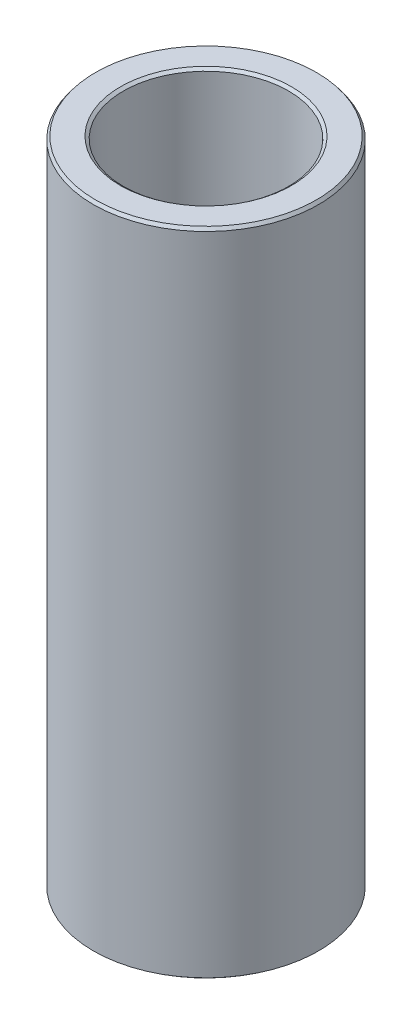
ISO-10303-21;
HEADER;
FILE_DESCRIPTION(('STEP AP214'),'2;1');
FILE_NAME('part.step','',(''),(''),'','','');
FILE_SCHEMA(('AUTOMOTIVE_DESIGN { 1 0 10303 214 1 1 1 1 }'));
ENDSEC;
DATA;
#1=APPLICATION_CONTEXT('core data for automotive mechanical design processes');
#2=APPLICATION_PROTOCOL_DEFINITION('international standard','automotive_design',2000,#1);
#3=PRODUCT_CONTEXT('',#1,'mechanical');
#4=PRODUCT('Part','Part','',(#3));
#5=PRODUCT_RELATED_PRODUCT_CATEGORY('part','',(#4));
#6=PRODUCT_DEFINITION_FORMATION('','',#4);
#7=PRODUCT_DEFINITION_CONTEXT('part definition',#1,'design');
#8=PRODUCT_DEFINITION('design','',#6,#7);
#9=PRODUCT_DEFINITION_SHAPE('','',#8);
#10=(LENGTH_UNIT() NAMED_UNIT(*) SI_UNIT(.MILLI.,.METRE.));
#11=(NAMED_UNIT(*) PLANE_ANGLE_UNIT() SI_UNIT($,.RADIAN.));
#12=(NAMED_UNIT(*) SI_UNIT($,.STERADIAN.) SOLID_ANGLE_UNIT());
#13=UNCERTAINTY_MEASURE_WITH_UNIT(LENGTH_MEASURE(1.E-05),#10,'distance_accuracy_value','');
#14=(GEOMETRIC_REPRESENTATION_CONTEXT(3) GLOBAL_UNCERTAINTY_ASSIGNED_CONTEXT((#13)) GLOBAL_UNIT_ASSIGNED_CONTEXT((#10,
#11,#12)) REPRESENTATION_CONTEXT('',''));
#15=CARTESIAN_POINT('',(0.,0.,0.));
#16=DIRECTION('',(0.,0.,1.));
#17=DIRECTION('',(1.,0.,0.));
#18=AXIS2_PLACEMENT_3D('',#15,#16,#17);
#19=CARTESIAN_POINT('',(0.,274.748979282671,0.));
#20=DIRECTION('',(0.,-1.,0.));
#21=DIRECTION('',(0.,0.,-1.));
#22=AXIS2_PLACEMENT_3D('',#19,#20,#21);
#23=CYLINDRICAL_SURFACE('',#22,47.5);
#24=CARTESIAN_POINT('',(0.,0.927045195719511,0.));
#25=DIRECTION('',(0.,1.,0.));
#26=DIRECTION('',(0.,0.,1.));
#27=AXIS2_PLACEMENT_3D('',#24,#25,#26);
#28=CIRCLE('',#27,47.5);
#29=CARTESIAN_POINT('',(0.,0.927045195719511,47.5));
#30=VERTEX_POINT('',#29);
#31=EDGE_CURVE('E10',#30,#30,#28,.T.);
#32=ORIENTED_EDGE('',*,*,#31,.T.);
#33=EDGE_LOOP('',(#32));
#34=FACE_BOUND('',#33,.T.);
#35=CARTESIAN_POINT('',(0.,273.504218241731,0.));
#36=DIRECTION('',(0.,1.,0.));
#37=DIRECTION('',(0.,0.,1.));
#38=AXIS2_PLACEMENT_3D('',#35,#36,#37);
#39=CIRCLE('',#38,47.5);
#40=CARTESIAN_POINT('',(0.,273.504218241731,47.5));
#41=VERTEX_POINT('',#40);
#42=EDGE_CURVE('E50',#41,#41,#39,.F.);
#43=ORIENTED_EDGE('',*,*,#42,.T.);
#44=EDGE_LOOP('',(#43));
#45=FACE_BOUND('',#44,.T.);
#46=ADVANCED_FACE('F39',(#34,#45),#23,.T.);
#47=CARTESIAN_POINT('',(0.,274.748979282671,0.));
#48=DIRECTION('',(0.,1.,0.));
#49=DIRECTION('',(0.,0.,1.));
#50=AXIS2_PLACEMENT_3D('',#47,#48,#49);
#51=PLANE('',#50);
#52=CARTESIAN_POINT('',(0.,274.748979282671,0.));
#53=DIRECTION('',(0.,1.,0.));
#54=DIRECTION('',(0.,0.,1.));
#55=AXIS2_PLACEMENT_3D('',#52,#53,#54);
#56=CIRCLE('',#55,36.099203072086);
#57=CARTESIAN_POINT('',(0.,274.748979282671,36.099203072086));
#58=VERTEX_POINT('',#57);
#59=EDGE_CURVE('E58',#58,#58,#56,.F.);
#60=ORIENTED_EDGE('',*,*,#59,.T.);
#61=EDGE_LOOP('',(#60));
#62=FACE_BOUND('',#61,.T.);
#63=CARTESIAN_POINT('',(0.,274.748979282671,0.));
#64=DIRECTION('',(0.,1.,0.));
#65=DIRECTION('',(0.,0.,1.));
#66=AXIS2_PLACEMENT_3D('',#63,#64,#65);
#67=CIRCLE('',#66,46.5729548042805);
#68=CARTESIAN_POINT('',(0.,274.748979282671,46.5729548042805));
#69=VERTEX_POINT('',#68);
#70=EDGE_CURVE('E61',#69,#69,#67,.T.);
#71=ORIENTED_EDGE('',*,*,#70,.T.);
#72=EDGE_LOOP('',(#71));
#73=FACE_BOUND('',#72,.T.);
#74=ADVANCED_FACE('F88',(#62,#73),#51,.T.);
#75=CARTESIAN_POINT('',(0.,0.,0.));
#76=DIRECTION('',(0.,1.,0.));
#77=DIRECTION('',(0.,0.,1.));
#78=AXIS2_PLACEMENT_3D('',#75,#76,#77);
#79=PLANE('',#78);
#80=CARTESIAN_POINT('',(0.,0.,0.));
#81=DIRECTION('',(0.,1.,0.));
#82=DIRECTION('',(0.,0.,1.));
#83=AXIS2_PLACEMENT_3D('',#80,#81,#82);
#84=CIRCLE('',#83,35.7814872268657);
#85=CARTESIAN_POINT('',(0.,0.,35.7814872268657));
#86=VERTEX_POINT('',#85);
#87=EDGE_CURVE('E51',#86,#86,#84,.T.);
#88=ORIENTED_EDGE('',*,*,#87,.T.);
#89=EDGE_LOOP('',(#88));
#90=FACE_BOUND('',#89,.T.);
#91=CARTESIAN_POINT('',(0.,0.,0.));
#92=DIRECTION('',(0.,1.,0.));
#93=DIRECTION('',(0.,0.,1.));
#94=AXIS2_PLACEMENT_3D('',#91,#92,#93);
#95=CIRCLE('',#94,46.2552389590602);
#96=CARTESIAN_POINT('',(0.,0.,46.2552389590602));
#97=VERTEX_POINT('',#96);
#98=EDGE_CURVE('E54',#97,#97,#95,.F.);
#99=ORIENTED_EDGE('',*,*,#98,.T.);
#100=EDGE_LOOP('',(#99));
#101=FACE_BOUND('',#100,.T.);
#102=ADVANCED_FACE('F83',(#90,#101),#79,.F.);
#103=CARTESIAN_POINT('',(0.,274.748979282671,0.));
#104=DIRECTION('',(0.,-1.,0.));
#105=DIRECTION('',(0.,0.,-1.));
#106=AXIS2_PLACEMENT_3D('',#103,#104,#105);
#107=CYLINDRICAL_SURFACE('',#106,34.8544420311462);
#108=CARTESIAN_POINT('',(0.,273.821934086951,0.));
#109=DIRECTION('',(0.,1.,0.));
#110=DIRECTION('',(0.,0.,1.));
#111=AXIS2_PLACEMENT_3D('',#108,#109,#110);
#112=CIRCLE('',#111,34.8544420311462);
#113=CARTESIAN_POINT('',(0.,273.821934086951,34.8544420311462));
#114=VERTEX_POINT('',#113);
#115=EDGE_CURVE('E67',#114,#114,#112,.T.);
#116=ORIENTED_EDGE('',*,*,#115,.T.);
#117=EDGE_LOOP('',(#116));
#118=FACE_BOUND('',#117,.T.);
#119=CARTESIAN_POINT('',(0.,1.24476104093985,0.));
#120=DIRECTION('',(0.,1.,0.));
#121=DIRECTION('',(0.,0.,1.));
#122=AXIS2_PLACEMENT_3D('',#119,#120,#121);
#123=CIRCLE('',#122,34.8544420311462);
#124=CARTESIAN_POINT('',(0.,1.24476104093985,34.8544420311462));
#125=VERTEX_POINT('',#124);
#126=EDGE_CURVE('E69',#125,#125,#123,.F.);
#127=ORIENTED_EDGE('',*,*,#126,.T.);
#128=EDGE_LOOP('',(#127));
#129=FACE_BOUND('',#128,.T.);
#130=ADVANCED_FACE('F71',(#118,#129),#107,.F.);
#131=CARTESIAN_POINT('',(0.,273.821934086951,0.));
#132=DIRECTION('',(0.,1.,0.));
#133=DIRECTION('',(0.,0.,1.));
#134=AXIS2_PLACEMENT_3D('',#131,#132,#133);
#135=CONICAL_SURFACE('',#134,34.8544420311462,0.930658831002769);
#136=ORIENTED_EDGE('',*,*,#59,.F.);
#137=EDGE_LOOP('',(#136));
#138=FACE_BOUND('',#137,.T.);
#139=ORIENTED_EDGE('',*,*,#115,.F.);
#140=EDGE_LOOP('',(#139));
#141=FACE_BOUND('',#140,.T.);
#142=ADVANCED_FACE('F77',(#138,#141),#135,.F.);
#143=CARTESIAN_POINT('',(0.,0.,0.));
#144=DIRECTION('',(0.,-1.,0.));
#145=DIRECTION('',(0.,0.,-1.));
#146=AXIS2_PLACEMENT_3D('',#143,#144,#145);
#147=CONICAL_SURFACE('',#146,35.7814872268657,0.640137495792116);
#148=ORIENTED_EDGE('',*,*,#126,.F.);
#149=EDGE_LOOP('',(#148));
#150=FACE_BOUND('',#149,.T.);
#151=ORIENTED_EDGE('',*,*,#87,.F.);
#152=EDGE_LOOP('',(#151));
#153=FACE_BOUND('',#152,.T.);
#154=ADVANCED_FACE('F73',(#150,#153),#147,.F.);
#155=CARTESIAN_POINT('',(0.,0.927045195719511,0.));
#156=DIRECTION('',(0.,1.,0.));
#157=DIRECTION('',(0.,0.,1.));
#158=AXIS2_PLACEMENT_3D('',#155,#156,#157);
#159=CONICAL_SURFACE('',#158,47.5,0.930658831002774);
#160=ORIENTED_EDGE('',*,*,#98,.F.);
#161=EDGE_LOOP('',(#160));
#162=FACE_BOUND('',#161,.T.);
#163=ORIENTED_EDGE('',*,*,#31,.F.);
#164=EDGE_LOOP('',(#163));
#165=FACE_BOUND('',#164,.T.);
#166=ADVANCED_FACE('F76',(#162,#165),#159,.T.);
#167=CARTESIAN_POINT('',(0.,274.748979282671,0.));
#168=DIRECTION('',(0.,-1.,0.));
#169=DIRECTION('',(0.,0.,-1.));
#170=AXIS2_PLACEMENT_3D('',#167,#168,#169);
#171=CONICAL_SURFACE('',#170,46.5729548042805,0.640137495792095);
#172=ORIENTED_EDGE('',*,*,#42,.F.);
#173=EDGE_LOOP('',(#172));
#174=FACE_BOUND('',#173,.T.);
#175=ORIENTED_EDGE('',*,*,#70,.F.);
#176=EDGE_LOOP('',(#175));
#177=FACE_BOUND('',#176,.T.);
#178=ADVANCED_FACE('F45',(#174,#177),#171,.T.);
#179=CLOSED_SHELL('',(#46,#74,#102,#130,#142,#154,#166,#178));
#180=MANIFOLD_SOLID_BREP('B2',#179);
#181=ADVANCED_BREP_SHAPE_REPRESENTATION('',(#18,#180),#14);
#182=SHAPE_DEFINITION_REPRESENTATION(#9,#181);
ENDSEC;
END-ISO-10303-21;
